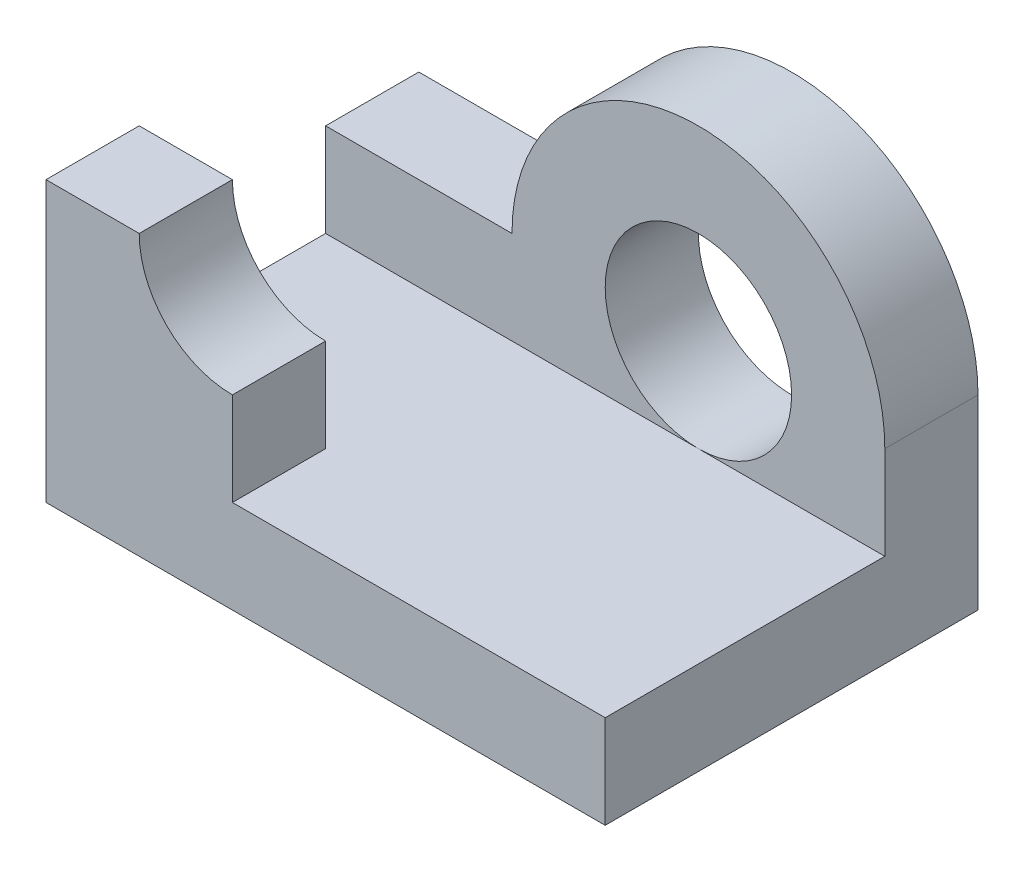
ISO-10303-21;
HEADER;
FILE_DESCRIPTION(('STEP AP214'),'2;1');
FILE_NAME('part.step','',(''),(''),'','','');
FILE_SCHEMA(('AUTOMOTIVE_DESIGN { 1 0 10303 214 1 1 1 1 }'));
ENDSEC;
DATA;
#1=APPLICATION_CONTEXT('core data for automotive mechanical design processes');
#2=APPLICATION_PROTOCOL_DEFINITION('international standard','automotive_design',2000,#1);
#3=PRODUCT_CONTEXT('',#1,'mechanical');
#4=PRODUCT('Part','Part','',(#3));
#5=PRODUCT_RELATED_PRODUCT_CATEGORY('part','',(#4));
#6=PRODUCT_DEFINITION_FORMATION('','',#4);
#7=PRODUCT_DEFINITION_CONTEXT('part definition',#1,'design');
#8=PRODUCT_DEFINITION('design','',#6,#7);
#9=PRODUCT_DEFINITION_SHAPE('','',#8);
#10=(LENGTH_UNIT() NAMED_UNIT(*) SI_UNIT(.MILLI.,.METRE.));
#11=(NAMED_UNIT(*) PLANE_ANGLE_UNIT() SI_UNIT($,.RADIAN.));
#12=(NAMED_UNIT(*) SI_UNIT($,.STERADIAN.) SOLID_ANGLE_UNIT());
#13=UNCERTAINTY_MEASURE_WITH_UNIT(LENGTH_MEASURE(1.E-05),#10,'distance_accuracy_value','');
#14=(GEOMETRIC_REPRESENTATION_CONTEXT(3) GLOBAL_UNCERTAINTY_ASSIGNED_CONTEXT((#13)) GLOBAL_UNIT_ASSIGNED_CONTEXT((#10,
#11,#12)) REPRESENTATION_CONTEXT('',''));
#15=CARTESIAN_POINT('',(0.,0.,0.));
#16=DIRECTION('',(0.,0.,1.));
#17=DIRECTION('',(1.,0.,0.));
#18=AXIS2_PLACEMENT_3D('',#15,#16,#17);
#19=CARTESIAN_POINT('',(0.,10.,0.));
#20=DIRECTION('',(0.,1.,0.));
#21=DIRECTION('',(0.,0.,1.));
#22=AXIS2_PLACEMENT_3D('',#19,#20,#21);
#23=PLANE('',#22);
#24=DIRECTION('',(0.,0.,1.));
#25=VECTOR('',#24,1.);
#26=CARTESIAN_POINT('',(-40.,10.,-10.));
#27=LINE('',#26,#25);
#28=CARTESIAN_POINT('',(-40.,10.,-10.));
#29=VERTEX_POINT('',#28);
#30=CARTESIAN_POINT('',(-40.,10.,0.));
#31=VERTEX_POINT('',#30);
#32=EDGE_CURVE('E137',#29,#31,#27,.T.);
#33=ORIENTED_EDGE('',*,*,#32,.T.);
#34=DIRECTION('',(1.,0.,0.));
#35=VECTOR('',#34,1.);
#36=CARTESIAN_POINT('',(0.,10.,0.));
#37=LINE('',#36,#35);
#38=CARTESIAN_POINT('',(0.,10.,0.));
#39=VERTEX_POINT('',#38);
#40=EDGE_CURVE('E233',#31,#39,#37,.T.);
#41=ORIENTED_EDGE('',*,*,#40,.T.);
#42=DIRECTION('',(0.,0.,-1.));
#43=VECTOR('',#42,1.);
#44=CARTESIAN_POINT('',(0.,10.,0.));
#45=LINE('',#44,#43);
#46=CARTESIAN_POINT('',(0.,10.,-30.));
#47=VERTEX_POINT('',#46);
#48=EDGE_CURVE('E226',#39,#47,#45,.T.);
#49=ORIENTED_EDGE('',*,*,#48,.T.);
#50=DIRECTION('',(-1.,0.,0.));
#51=VECTOR('',#50,1.);
#52=CARTESIAN_POINT('',(-60.,10.,-30.));
#53=LINE('',#52,#51);
#54=CARTESIAN_POINT('',(-20.,10.,-30.));
#55=VERTEX_POINT('',#54);
#56=EDGE_CURVE('E186',#47,#55,#53,.T.);
#57=ORIENTED_EDGE('',*,*,#56,.T.);
#58=CARTESIAN_POINT('',(-60.,10.,-30.));
#59=VERTEX_POINT('',#58);
#60=EDGE_CURVE('E191',#55,#59,#53,.T.);
#61=ORIENTED_EDGE('',*,*,#60,.T.);
#62=DIRECTION('',(0.,0.,1.));
#63=VECTOR('',#62,1.);
#64=CARTESIAN_POINT('',(-60.,10.,0.));
#65=LINE('',#64,#63);
#66=CARTESIAN_POINT('',(-60.,10.,-10.));
#67=VERTEX_POINT('',#66);
#68=EDGE_CURVE('E60',#59,#67,#65,.T.);
#69=ORIENTED_EDGE('',*,*,#68,.T.);
#70=DIRECTION('',(1.,0.,0.));
#71=VECTOR('',#70,1.);
#72=CARTESIAN_POINT('',(-40.,10.,-10.));
#73=LINE('',#72,#71);
#74=EDGE_CURVE('E55',#67,#29,#73,.T.);
#75=ORIENTED_EDGE('',*,*,#74,.T.);
#76=EDGE_LOOP('',(#33,#41,#49,#57,#61,#69,#75));
#77=FACE_BOUND('',#76,.T.);
#78=ADVANCED_FACE('F39',(#77),#23,.T.);
#79=CARTESIAN_POINT('',(0.,10.,0.));
#80=DIRECTION('',(-1.,0.,0.));
#81=DIRECTION('',(0.,0.,1.));
#82=AXIS2_PLACEMENT_3D('',#79,#80,#81);
#83=PLANE('',#82);
#84=DIRECTION('',(0.,0.,-1.));
#85=VECTOR('',#84,1.);
#86=CARTESIAN_POINT('',(0.,0.,0.));
#87=LINE('',#86,#85);
#88=CARTESIAN_POINT('',(0.,0.,0.));
#89=VERTEX_POINT('',#88);
#90=CARTESIAN_POINT('',(0.,0.,-40.));
#91=VERTEX_POINT('',#90);
#92=EDGE_CURVE('E219',#89,#91,#87,.T.);
#93=ORIENTED_EDGE('',*,*,#92,.T.);
#94=DIRECTION('',(0.,-1.,0.));
#95=VECTOR('',#94,1.);
#96=CARTESIAN_POINT('',(0.,10.,-40.));
#97=LINE('',#96,#95);
#98=CARTESIAN_POINT('',(0.,20.,-40.));
#99=VERTEX_POINT('',#98);
#100=EDGE_CURVE('E11',#99,#91,#97,.T.);
#101=ORIENTED_EDGE('',*,*,#100,.F.);
#102=DIRECTION('',(0.,0.,-1.));
#103=VECTOR('',#102,1.);
#104=CARTESIAN_POINT('',(0.,20.,-30.));
#105=LINE('',#104,#103);
#106=CARTESIAN_POINT('',(0.,20.,-30.));
#107=VERTEX_POINT('',#106);
#108=EDGE_CURVE('E215',#107,#99,#105,.T.);
#109=ORIENTED_EDGE('',*,*,#108,.F.);
#110=DIRECTION('',(0.,-1.,0.));
#111=VECTOR('',#110,1.);
#112=CARTESIAN_POINT('',(0.,10.,-30.));
#113=LINE('',#112,#111);
#114=EDGE_CURVE('E203',#107,#47,#113,.T.);
#115=ORIENTED_EDGE('',*,*,#114,.T.);
#116=ORIENTED_EDGE('',*,*,#48,.F.);
#117=DIRECTION('',(0.,-1.,0.));
#118=VECTOR('',#117,1.);
#119=CARTESIAN_POINT('',(0.,10.,0.));
#120=LINE('',#119,#118);
#121=EDGE_CURVE('E236',#39,#89,#120,.T.);
#122=ORIENTED_EDGE('',*,*,#121,.T.);
#123=EDGE_LOOP('',(#93,#101,#109,#115,#116,#122));
#124=FACE_BOUND('',#123,.T.);
#125=ADVANCED_FACE('F41',(#124),#83,.F.);
#126=CARTESIAN_POINT('',(0.,10.,-40.));
#127=DIRECTION('',(0.,0.,1.));
#128=DIRECTION('',(1.,0.,0.));
#129=AXIS2_PLACEMENT_3D('',#126,#127,#128);
#130=PLANE('',#129);
#131=CARTESIAN_POINT('',(-20.,20.,-40.));
#132=DIRECTION('',(0.,0.,1.));
#133=DIRECTION('',(1.,0.,0.));
#134=AXIS2_PLACEMENT_3D('',#131,#132,#133);
#135=CIRCLE('',#134,10.);
#136=CARTESIAN_POINT('',(-10.,20.,-40.));
#137=VERTEX_POINT('',#136);
#138=EDGE_CURVE('E179',#137,#137,#135,.T.);
#139=ORIENTED_EDGE('',*,*,#138,.T.);
#140=EDGE_LOOP('',(#139));
#141=FACE_BOUND('',#140,.T.);
#142=DIRECTION('',(-1.,0.,0.));
#143=VECTOR('',#142,1.);
#144=CARTESIAN_POINT('',(0.,0.,-40.));
#145=LINE('',#144,#143);
#146=CARTESIAN_POINT('',(-60.,0.,-40.));
#147=VERTEX_POINT('',#146);
#148=EDGE_CURVE('E240',#91,#147,#145,.T.);
#149=ORIENTED_EDGE('',*,*,#148,.T.);
#150=DIRECTION('',(0.,-1.,0.));
#151=VECTOR('',#150,1.);
#152=CARTESIAN_POINT('',(-60.,10.,-40.));
#153=LINE('',#152,#151);
#154=CARTESIAN_POINT('',(-60.,20.,-40.));
#155=VERTEX_POINT('',#154);
#156=EDGE_CURVE('E48',#155,#147,#153,.T.);
#157=ORIENTED_EDGE('',*,*,#156,.F.);
#158=DIRECTION('',(1.,0.,0.));
#159=VECTOR('',#158,1.);
#160=CARTESIAN_POINT('',(-40.,20.,-40.));
#161=LINE('',#160,#159);
#162=CARTESIAN_POINT('',(-40.,20.,-40.));
#163=VERTEX_POINT('',#162);
#164=EDGE_CURVE('E183',#155,#163,#161,.T.);
#165=ORIENTED_EDGE('',*,*,#164,.T.);
#166=CARTESIAN_POINT('',(-20.,20.,-40.));
#167=DIRECTION('',(0.,0.,-1.));
#168=DIRECTION('',(1.,0.,0.));
#169=AXIS2_PLACEMENT_3D('',#166,#167,#168);
#170=CIRCLE('',#169,20.);
#171=EDGE_CURVE('E211',#163,#99,#170,.T.);
#172=ORIENTED_EDGE('',*,*,#171,.T.);
#173=ORIENTED_EDGE('',*,*,#100,.T.);
#174=EDGE_LOOP('',(#149,#157,#165,#172,#173));
#175=FACE_BOUND('',#174,.T.);
#176=ADVANCED_FACE('F284',(#141,#175),#130,.F.);
#177=CARTESIAN_POINT('',(-60.,10.,0.));
#178=DIRECTION('',(1.,0.,0.));
#179=DIRECTION('',(0.,0.,-1.));
#180=AXIS2_PLACEMENT_3D('',#177,#178,#179);
#181=PLANE('',#180);
#182=DIRECTION('',(0.,0.,1.));
#183=VECTOR('',#182,1.);
#184=CARTESIAN_POINT('',(-60.,0.,0.));
#185=LINE('',#184,#183);
#186=CARTESIAN_POINT('',(-60.,0.,0.));
#187=VERTEX_POINT('',#186);
#188=EDGE_CURVE('E243',#147,#187,#185,.T.);
#189=ORIENTED_EDGE('',*,*,#188,.T.);
#190=DIRECTION('',(0.,-1.,0.));
#191=VECTOR('',#190,1.);
#192=CARTESIAN_POINT('',(-60.,10.,0.));
#193=LINE('',#192,#191);
#194=CARTESIAN_POINT('',(-60.,30.,0.));
#195=VERTEX_POINT('',#194);
#196=EDGE_CURVE('E251',#195,#187,#193,.T.);
#197=ORIENTED_EDGE('',*,*,#196,.F.);
#198=DIRECTION('',(0.,0.,1.));
#199=VECTOR('',#198,1.);
#200=CARTESIAN_POINT('',(-60.,30.,-10.));
#201=LINE('',#200,#199);
#202=CARTESIAN_POINT('',(-60.,30.,-10.));
#203=VERTEX_POINT('',#202);
#204=EDGE_CURVE('E170',#203,#195,#201,.T.);
#205=ORIENTED_EDGE('',*,*,#204,.F.);
#206=DIRECTION('',(0.,-1.,0.));
#207=VECTOR('',#206,1.);
#208=CARTESIAN_POINT('',(-60.,10.,-10.));
#209=LINE('',#208,#207);
#210=EDGE_CURVE('E158',#203,#67,#209,.T.);
#211=ORIENTED_EDGE('',*,*,#210,.T.);
#212=ORIENTED_EDGE('',*,*,#68,.F.);
#213=DIRECTION('',(0.,1.,0.));
#214=VECTOR('',#213,1.);
#215=CARTESIAN_POINT('',(-60.,20.,-30.));
#216=LINE('',#215,#214);
#217=CARTESIAN_POINT('',(-60.,20.,-30.));
#218=VERTEX_POINT('',#217);
#219=EDGE_CURVE('E190',#59,#218,#216,.T.);
#220=ORIENTED_EDGE('',*,*,#219,.T.);
#221=DIRECTION('',(0.,0.,-1.));
#222=VECTOR('',#221,1.);
#223=CARTESIAN_POINT('',(-60.,20.,-30.));
#224=LINE('',#223,#222);
#225=EDGE_CURVE('E207',#218,#155,#224,.T.);
#226=ORIENTED_EDGE('',*,*,#225,.T.);
#227=ORIENTED_EDGE('',*,*,#156,.T.);
#228=EDGE_LOOP('',(#189,#197,#205,#211,#212,#220,#226,#227));
#229=FACE_BOUND('',#228,.T.);
#230=ADVANCED_FACE('F258',(#229),#181,.F.);
#231=CARTESIAN_POINT('',(0.,10.,0.));
#232=DIRECTION('',(0.,0.,-1.));
#233=DIRECTION('',(-1.,0.,0.));
#234=AXIS2_PLACEMENT_3D('',#231,#232,#233);
#235=PLANE('',#234);
#236=DIRECTION('',(1.,0.,0.));
#237=VECTOR('',#236,1.);
#238=CARTESIAN_POINT('',(0.,0.,0.));
#239=LINE('',#238,#237);
#240=EDGE_CURVE('E230',#187,#89,#239,.T.);
#241=ORIENTED_EDGE('',*,*,#240,.T.);
#242=ORIENTED_EDGE('',*,*,#121,.F.);
#243=ORIENTED_EDGE('',*,*,#40,.F.);
#244=DIRECTION('',(0.,1.,0.));
#245=VECTOR('',#244,1.);
#246=CARTESIAN_POINT('',(-40.,20.,0.));
#247=LINE('',#246,#245);
#248=CARTESIAN_POINT('',(-40.,20.,0.));
#249=VERTEX_POINT('',#248);
#250=EDGE_CURVE('E162',#31,#249,#247,.T.);
#251=ORIENTED_EDGE('',*,*,#250,.T.);
#252=CARTESIAN_POINT('',(-40.,30.,0.));
#253=DIRECTION('',(0.,0.,-1.));
#254=DIRECTION('',(1.,0.,0.));
#255=AXIS2_PLACEMENT_3D('',#252,#253,#254);
#256=CIRCLE('',#255,10.);
#257=CARTESIAN_POINT('',(-50.,30.,0.));
#258=VERTEX_POINT('',#257);
#259=EDGE_CURVE('E130',#249,#258,#256,.T.);
#260=ORIENTED_EDGE('',*,*,#259,.T.);
#261=DIRECTION('',(-1.,0.,0.));
#262=VECTOR('',#261,1.);
#263=CARTESIAN_POINT('',(-60.,30.,0.));
#264=LINE('',#263,#262);
#265=EDGE_CURVE('E153',#258,#195,#264,.T.);
#266=ORIENTED_EDGE('',*,*,#265,.T.);
#267=ORIENTED_EDGE('',*,*,#196,.T.);
#268=EDGE_LOOP('',(#241,#242,#243,#251,#260,#266,#267));
#269=FACE_BOUND('',#268,.T.);
#270=ADVANCED_FACE('F267',(#269),#235,.F.);
#271=CARTESIAN_POINT('',(0.,0.,0.));
#272=DIRECTION('',(0.,1.,0.));
#273=DIRECTION('',(0.,0.,1.));
#274=AXIS2_PLACEMENT_3D('',#271,#272,#273);
#275=PLANE('',#274);
#276=ORIENTED_EDGE('',*,*,#92,.F.);
#277=ORIENTED_EDGE('',*,*,#240,.F.);
#278=ORIENTED_EDGE('',*,*,#188,.F.);
#279=ORIENTED_EDGE('',*,*,#148,.F.);
#280=EDGE_LOOP('',(#276,#277,#278,#279));
#281=FACE_BOUND('',#280,.T.);
#282=ADVANCED_FACE('F264',(#281),#275,.F.);
#283=CARTESIAN_POINT('',(-20.,20.,-30.));
#284=DIRECTION('',(0.,0.,-1.));
#285=DIRECTION('',(-1.,0.,0.));
#286=AXIS2_PLACEMENT_3D('',#283,#284,#285);
#287=CYLINDRICAL_SURFACE('',#286,20.);
#288=ORIENTED_EDGE('',*,*,#171,.F.);
#289=DIRECTION('',(0.,0.,-1.));
#290=VECTOR('',#289,1.);
#291=CARTESIAN_POINT('',(-40.,20.,-30.));
#292=LINE('',#291,#290);
#293=CARTESIAN_POINT('',(-40.,20.,-30.));
#294=VERTEX_POINT('',#293);
#295=EDGE_CURVE('E220',#294,#163,#292,.T.);
#296=ORIENTED_EDGE('',*,*,#295,.F.);
#297=CARTESIAN_POINT('',(-20.,20.,-30.));
#298=DIRECTION('',(0.,0.,-1.));
#299=DIRECTION('',(1.,0.,0.));
#300=AXIS2_PLACEMENT_3D('',#297,#298,#299);
#301=CIRCLE('',#300,20.);
#302=EDGE_CURVE('E199',#294,#107,#301,.T.);
#303=ORIENTED_EDGE('',*,*,#302,.T.);
#304=ORIENTED_EDGE('',*,*,#108,.T.);
#305=EDGE_LOOP('',(#288,#296,#303,#304));
#306=FACE_BOUND('',#305,.T.);
#307=ADVANCED_FACE('F286',(#306),#287,.T.);
#308=CARTESIAN_POINT('',(-40.,20.,-30.));
#309=DIRECTION('',(0.,1.,0.));
#310=DIRECTION('',(0.,0.,1.));
#311=AXIS2_PLACEMENT_3D('',#308,#309,#310);
#312=PLANE('',#311);
#313=ORIENTED_EDGE('',*,*,#164,.F.);
#314=ORIENTED_EDGE('',*,*,#225,.F.);
#315=DIRECTION('',(1.,0.,0.));
#316=VECTOR('',#315,1.);
#317=CARTESIAN_POINT('',(-40.,20.,-30.));
#318=LINE('',#317,#316);
#319=EDGE_CURVE('E195',#218,#294,#318,.T.);
#320=ORIENTED_EDGE('',*,*,#319,.T.);
#321=ORIENTED_EDGE('',*,*,#295,.T.);
#322=EDGE_LOOP('',(#313,#314,#320,#321));
#323=FACE_BOUND('',#322,.T.);
#324=ADVANCED_FACE('F282',(#323),#312,.T.);
#325=CARTESIAN_POINT('',(-20.,20.,-30.));
#326=DIRECTION('',(0.,0.,1.));
#327=DIRECTION('',(1.,0.,0.));
#328=AXIS2_PLACEMENT_3D('',#325,#326,#327);
#329=PLANE('',#328);
#330=ORIENTED_EDGE('',*,*,#60,.F.);
#331=CARTESIAN_POINT('',(-20.,20.,-30.));
#332=DIRECTION('',(0.,0.,1.));
#333=DIRECTION('',(1.,0.,0.));
#334=AXIS2_PLACEMENT_3D('',#331,#332,#333);
#335=CIRCLE('',#334,10.);
#336=EDGE_CURVE('E174',#55,#55,#335,.T.);
#337=ORIENTED_EDGE('',*,*,#336,.F.);
#338=ORIENTED_EDGE('',*,*,#56,.F.);
#339=ORIENTED_EDGE('',*,*,#114,.F.);
#340=ORIENTED_EDGE('',*,*,#302,.F.);
#341=ORIENTED_EDGE('',*,*,#319,.F.);
#342=ORIENTED_EDGE('',*,*,#219,.F.);
#343=EDGE_LOOP('',(#330,#337,#338,#339,#340,#341,#342));
#344=FACE_BOUND('',#343,.T.);
#345=ADVANCED_FACE('F278',(#344),#329,.T.);
#346=CARTESIAN_POINT('',(-20.,20.,-40.));
#347=DIRECTION('',(0.,0.,1.));
#348=DIRECTION('',(1.,0.,0.));
#349=AXIS2_PLACEMENT_3D('',#346,#347,#348);
#350=CYLINDRICAL_SURFACE('',#349,10.);
#351=ORIENTED_EDGE('',*,*,#138,.F.);
#352=EDGE_LOOP('',(#351));
#353=FACE_BOUND('',#352,.T.);
#354=ORIENTED_EDGE('',*,*,#336,.T.);
#355=EDGE_LOOP('',(#354));
#356=FACE_BOUND('',#355,.T.);
#357=ADVANCED_FACE('F288',(#353,#356),#350,.F.);
#358=CARTESIAN_POINT('',(-60.,30.,-10.));
#359=DIRECTION('',(0.,1.,0.));
#360=DIRECTION('',(0.,0.,1.));
#361=AXIS2_PLACEMENT_3D('',#358,#359,#360);
#362=PLANE('',#361);
#363=ORIENTED_EDGE('',*,*,#265,.F.);
#364=DIRECTION('',(0.,0.,1.));
#365=VECTOR('',#364,1.);
#366=CARTESIAN_POINT('',(-50.,30.,-10.));
#367=LINE('',#366,#365);
#368=CARTESIAN_POINT('',(-50.,30.,-10.));
#369=VERTEX_POINT('',#368);
#370=EDGE_CURVE('E136',#369,#258,#367,.T.);
#371=ORIENTED_EDGE('',*,*,#370,.F.);
#372=DIRECTION('',(-1.,0.,0.));
#373=VECTOR('',#372,1.);
#374=CARTESIAN_POINT('',(-60.,30.,-10.));
#375=LINE('',#374,#373);
#376=EDGE_CURVE('E146',#369,#203,#375,.T.);
#377=ORIENTED_EDGE('',*,*,#376,.T.);
#378=ORIENTED_EDGE('',*,*,#204,.T.);
#379=EDGE_LOOP('',(#363,#371,#377,#378));
#380=FACE_BOUND('',#379,.T.);
#381=ADVANCED_FACE('F273',(#380),#362,.T.);
#382=CARTESIAN_POINT('',(-40.,30.,-10.));
#383=DIRECTION('',(0.,0.,1.));
#384=DIRECTION('',(1.,0.,0.));
#385=AXIS2_PLACEMENT_3D('',#382,#383,#384);
#386=CYLINDRICAL_SURFACE('',#385,10.);
#387=ORIENTED_EDGE('',*,*,#259,.F.);
#388=DIRECTION('',(0.,0.,1.));
#389=VECTOR('',#388,1.);
#390=CARTESIAN_POINT('',(-40.,20.,-10.));
#391=LINE('',#390,#389);
#392=CARTESIAN_POINT('',(-40.,20.,-10.));
#393=VERTEX_POINT('',#392);
#394=EDGE_CURVE('E125',#393,#249,#391,.T.);
#395=ORIENTED_EDGE('',*,*,#394,.F.);
#396=CARTESIAN_POINT('',(-40.,30.,-10.));
#397=DIRECTION('',(0.,0.,-1.));
#398=DIRECTION('',(1.,0.,0.));
#399=AXIS2_PLACEMENT_3D('',#396,#397,#398);
#400=CIRCLE('',#399,10.);
#401=EDGE_CURVE('E128',#393,#369,#400,.T.);
#402=ORIENTED_EDGE('',*,*,#401,.T.);
#403=ORIENTED_EDGE('',*,*,#370,.T.);
#404=EDGE_LOOP('',(#387,#395,#402,#403));
#405=FACE_BOUND('',#404,.T.);
#406=ADVANCED_FACE('F127',(#405),#386,.F.);
#407=CARTESIAN_POINT('',(-40.,20.,-10.));
#408=DIRECTION('',(1.,0.,0.));
#409=DIRECTION('',(0.,1.,0.));
#410=AXIS2_PLACEMENT_3D('',#407,#408,#409);
#411=PLANE('',#410);
#412=ORIENTED_EDGE('',*,*,#250,.F.);
#413=ORIENTED_EDGE('',*,*,#32,.F.);
#414=DIRECTION('',(0.,1.,0.));
#415=VECTOR('',#414,1.);
#416=CARTESIAN_POINT('',(-40.,20.,-10.));
#417=LINE('',#416,#415);
#418=EDGE_CURVE('E143',#29,#393,#417,.T.);
#419=ORIENTED_EDGE('',*,*,#418,.T.);
#420=ORIENTED_EDGE('',*,*,#394,.T.);
#421=EDGE_LOOP('',(#412,#413,#419,#420));
#422=FACE_BOUND('',#421,.T.);
#423=ADVANCED_FACE('F149',(#422),#411,.T.);
#424=CARTESIAN_POINT('',(-40.,30.,-10.));
#425=DIRECTION('',(0.,0.,1.));
#426=DIRECTION('',(1.,0.,0.));
#427=AXIS2_PLACEMENT_3D('',#424,#425,#426);
#428=PLANE('',#427);
#429=ORIENTED_EDGE('',*,*,#74,.F.);
#430=ORIENTED_EDGE('',*,*,#210,.F.);
#431=ORIENTED_EDGE('',*,*,#376,.F.);
#432=ORIENTED_EDGE('',*,*,#401,.F.);
#433=ORIENTED_EDGE('',*,*,#418,.F.);
#434=EDGE_LOOP('',(#429,#430,#431,#432,#433));
#435=FACE_BOUND('',#434,.T.);
#436=ADVANCED_FACE('F142',(#435),#428,.F.);
#437=CLOSED_SHELL('',(#78,#125,#176,#230,#270,#282,#307,#324,#345,#357,#381,#406,#423,#436));
#438=MANIFOLD_SOLID_BREP('B2',#437);
#439=ADVANCED_BREP_SHAPE_REPRESENTATION('',(#18,#438),#14);
#440=SHAPE_DEFINITION_REPRESENTATION(#9,#439);
ENDSEC;
END-ISO-10303-21;
